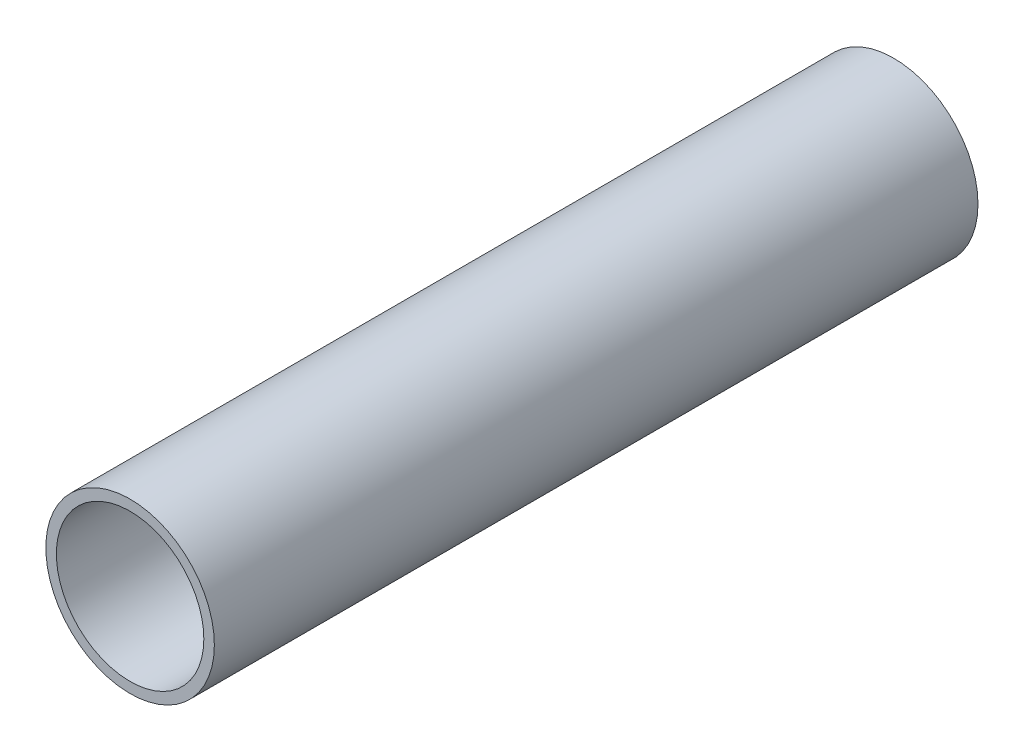
ISO-10303-21;
HEADER;
FILE_DESCRIPTION(('STEP AP214'),'2;1');
FILE_NAME('part.step','',(''),(''),'','','');
FILE_SCHEMA(('AUTOMOTIVE_DESIGN { 1 0 10303 214 1 1 1 1 }'));
ENDSEC;
DATA;
#1=APPLICATION_CONTEXT('core data for automotive mechanical design processes');
#2=APPLICATION_PROTOCOL_DEFINITION('international standard','automotive_design',2000,#1);
#3=PRODUCT_CONTEXT('',#1,'mechanical');
#4=PRODUCT('Part','Part','',(#3));
#5=PRODUCT_RELATED_PRODUCT_CATEGORY('part','',(#4));
#6=PRODUCT_DEFINITION_FORMATION('','',#4);
#7=PRODUCT_DEFINITION_CONTEXT('part definition',#1,'design');
#8=PRODUCT_DEFINITION('design','',#6,#7);
#9=PRODUCT_DEFINITION_SHAPE('','',#8);
#10=(LENGTH_UNIT() NAMED_UNIT(*) SI_UNIT(.MILLI.,.METRE.));
#11=(NAMED_UNIT(*) PLANE_ANGLE_UNIT() SI_UNIT($,.RADIAN.));
#12=(NAMED_UNIT(*) SI_UNIT($,.STERADIAN.) SOLID_ANGLE_UNIT());
#13=UNCERTAINTY_MEASURE_WITH_UNIT(LENGTH_MEASURE(1.E-05),#10,'distance_accuracy_value','');
#14=(GEOMETRIC_REPRESENTATION_CONTEXT(3) GLOBAL_UNCERTAINTY_ASSIGNED_CONTEXT((#13)) GLOBAL_UNIT_ASSIGNED_CONTEXT((#10,
#11,#12)) REPRESENTATION_CONTEXT('',''));
#15=CARTESIAN_POINT('',(0.,0.,0.));
#16=DIRECTION('',(0.,0.,1.));
#17=DIRECTION('',(1.,0.,0.));
#18=AXIS2_PLACEMENT_3D('',#15,#16,#17);
#19=CARTESIAN_POINT('',(0.,0.,145.));
#20=DIRECTION('',(0.,0.,1.));
#21=DIRECTION('',(1.,0.,0.));
#22=AXIS2_PLACEMENT_3D('',#19,#20,#21);
#23=PLANE('',#22);
#24=CARTESIAN_POINT('',(0.,0.,145.));
#25=DIRECTION('',(0.,0.,1.));
#26=DIRECTION('',(1.,0.,0.));
#27=AXIS2_PLACEMENT_3D('',#24,#25,#26);
#28=CIRCLE('',#27,16.);
#29=CARTESIAN_POINT('',(16.,0.,145.));
#30=VERTEX_POINT('',#29);
#31=EDGE_CURVE('E10',#30,#30,#28,.T.);
#32=ORIENTED_EDGE('',*,*,#31,.T.);
#33=EDGE_LOOP('',(#32));
#34=FACE_BOUND('',#33,.T.);
#35=CARTESIAN_POINT('',(0.,0.,145.));
#36=DIRECTION('',(0.,0.,1.));
#37=DIRECTION('',(1.,0.,0.));
#38=AXIS2_PLACEMENT_3D('',#35,#36,#37);
#39=CIRCLE('',#38,14.);
#40=CARTESIAN_POINT('',(14.,0.,145.));
#41=VERTEX_POINT('',#40);
#42=EDGE_CURVE('E50',#41,#41,#39,.T.);
#43=ORIENTED_EDGE('',*,*,#42,.F.);
#44=EDGE_LOOP('',(#43));
#45=FACE_BOUND('',#44,.T.);
#46=ADVANCED_FACE('F39',(#34,#45),#23,.T.);
#47=CARTESIAN_POINT('',(0.,0.,0.));
#48=DIRECTION('',(0.,0.,1.));
#49=DIRECTION('',(1.,0.,0.));
#50=AXIS2_PLACEMENT_3D('',#47,#48,#49);
#51=PLANE('',#50);
#52=CARTESIAN_POINT('',(0.,0.,0.));
#53=DIRECTION('',(0.,0.,1.));
#54=DIRECTION('',(1.,0.,0.));
#55=AXIS2_PLACEMENT_3D('',#52,#53,#54);
#56=CIRCLE('',#55,16.);
#57=CARTESIAN_POINT('',(16.,0.,0.));
#58=VERTEX_POINT('',#57);
#59=EDGE_CURVE('E43',#58,#58,#56,.T.);
#60=ORIENTED_EDGE('',*,*,#59,.F.);
#61=EDGE_LOOP('',(#60));
#62=FACE_BOUND('',#61,.T.);
#63=CARTESIAN_POINT('',(0.,0.,0.));
#64=DIRECTION('',(0.,0.,1.));
#65=DIRECTION('',(1.,0.,0.));
#66=AXIS2_PLACEMENT_3D('',#63,#64,#65);
#67=CIRCLE('',#66,14.);
#68=CARTESIAN_POINT('',(14.,0.,0.));
#69=VERTEX_POINT('',#68);
#70=EDGE_CURVE('E52',#69,#69,#67,.T.);
#71=ORIENTED_EDGE('',*,*,#70,.T.);
#72=EDGE_LOOP('',(#71));
#73=FACE_BOUND('',#72,.T.);
#74=ADVANCED_FACE('F62',(#62,#73),#51,.F.);
#75=CARTESIAN_POINT('',(0.,0.,145.));
#76=DIRECTION('',(0.,0.,-1.));
#77=DIRECTION('',(-1.,0.,0.));
#78=AXIS2_PLACEMENT_3D('',#75,#76,#77);
#79=CYLINDRICAL_SURFACE('',#78,16.);
#80=ORIENTED_EDGE('',*,*,#31,.F.);
#81=EDGE_LOOP('',(#80));
#82=FACE_BOUND('',#81,.T.);
#83=ORIENTED_EDGE('',*,*,#59,.T.);
#84=EDGE_LOOP('',(#83));
#85=FACE_BOUND('',#84,.T.);
#86=ADVANCED_FACE('F41',(#82,#85),#79,.T.);
#87=CARTESIAN_POINT('',(0.,0.,145.));
#88=DIRECTION('',(0.,0.,-1.));
#89=DIRECTION('',(-1.,0.,0.));
#90=AXIS2_PLACEMENT_3D('',#87,#88,#89);
#91=CYLINDRICAL_SURFACE('',#90,14.);
#92=ORIENTED_EDGE('',*,*,#42,.T.);
#93=EDGE_LOOP('',(#92));
#94=FACE_BOUND('',#93,.T.);
#95=ORIENTED_EDGE('',*,*,#70,.F.);
#96=EDGE_LOOP('',(#95));
#97=FACE_BOUND('',#96,.T.);
#98=ADVANCED_FACE('F58',(#94,#97),#91,.F.);
#99=CLOSED_SHELL('',(#46,#74,#86,#98));
#100=MANIFOLD_SOLID_BREP('B2',#99);
#101=ADVANCED_BREP_SHAPE_REPRESENTATION('',(#18,#100),#14);
#102=SHAPE_DEFINITION_REPRESENTATION(#9,#101);
ENDSEC;
END-ISO-10303-21;
